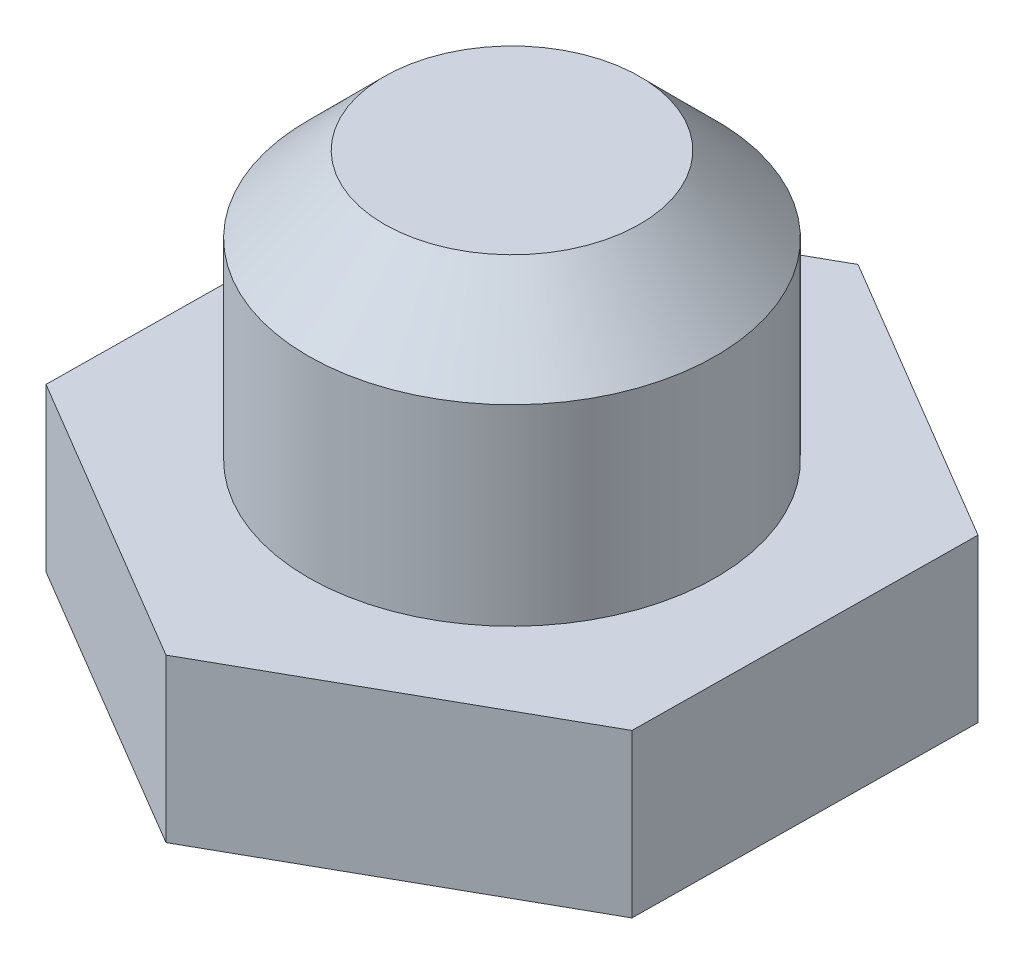
ISO-10303-21;
HEADER;
FILE_DESCRIPTION(('STEP AP214'),'2;1');
FILE_NAME('part.step','',(''),(''),'','','');
FILE_SCHEMA(('AUTOMOTIVE_DESIGN { 1 0 10303 214 1 1 1 1 }'));
ENDSEC;
DATA;
#1=APPLICATION_CONTEXT('core data for automotive mechanical design processes');
#2=APPLICATION_PROTOCOL_DEFINITION('international standard','automotive_design',2000,#1);
#3=PRODUCT_CONTEXT('',#1,'mechanical');
#4=PRODUCT('Part','Part','',(#3));
#5=PRODUCT_RELATED_PRODUCT_CATEGORY('part','',(#4));
#6=PRODUCT_DEFINITION_FORMATION('','',#4);
#7=PRODUCT_DEFINITION_CONTEXT('part definition',#1,'design');
#8=PRODUCT_DEFINITION('design','',#6,#7);
#9=PRODUCT_DEFINITION_SHAPE('','',#8);
#10=(LENGTH_UNIT() NAMED_UNIT(*) SI_UNIT(.MILLI.,.METRE.));
#11=(NAMED_UNIT(*) PLANE_ANGLE_UNIT() SI_UNIT($,.RADIAN.));
#12=(NAMED_UNIT(*) SI_UNIT($,.STERADIAN.) SOLID_ANGLE_UNIT());
#13=UNCERTAINTY_MEASURE_WITH_UNIT(LENGTH_MEASURE(1.E-05),#10,'distance_accuracy_value','');
#14=(GEOMETRIC_REPRESENTATION_CONTEXT(3) GLOBAL_UNCERTAINTY_ASSIGNED_CONTEXT((#13)) GLOBAL_UNIT_ASSIGNED_CONTEXT((#10,
#11,#12)) REPRESENTATION_CONTEXT('',''));
#15=CARTESIAN_POINT('',(0.,0.,0.));
#16=DIRECTION('',(0.,0.,1.));
#17=DIRECTION('',(1.,0.,0.));
#18=AXIS2_PLACEMENT_3D('',#15,#16,#17);
#19=CARTESIAN_POINT('',(0.,-60.706,0.));
#20=DIRECTION('',(0.,-1.,0.));
#21=DIRECTION('',(0.,0.,-1.));
#22=AXIS2_PLACEMENT_3D('',#19,#20,#21);
#23=CYLINDRICAL_SURFACE('',#22,6.38048);
#24=CARTESIAN_POINT('',(0.,-63.086000066,0.));
#25=DIRECTION('',(0.,1.,0.));
#26=DIRECTION('',(0.,0.,1.));
#27=AXIS2_PLACEMENT_3D('',#24,#25,#26);
#28=CIRCLE('',#27,6.38048);
#29=CARTESIAN_POINT('',(0.,-63.086000066,6.38048));
#30=VERTEX_POINT('',#29);
#31=EDGE_CURVE('E11',#30,#30,#28,.F.);
#32=ORIENTED_EDGE('',*,*,#31,.T.);
#33=EDGE_LOOP('',(#32));
#34=FACE_BOUND('',#33,.T.);
#35=CARTESIAN_POINT('',(0.,-69.088,0.));
#36=DIRECTION('',(0.,1.,0.));
#37=DIRECTION('',(0.,0.,1.));
#38=AXIS2_PLACEMENT_3D('',#35,#36,#37);
#39=CIRCLE('',#38,6.38048);
#40=CARTESIAN_POINT('',(0.,-69.088,6.38048));
#41=VERTEX_POINT('',#40);
#42=EDGE_CURVE('E143',#41,#41,#39,.T.);
#43=ORIENTED_EDGE('',*,*,#42,.T.);
#44=EDGE_LOOP('',(#43));
#45=FACE_BOUND('',#44,.T.);
#46=ADVANCED_FACE('F37',(#34,#45),#23,.T.);
#47=CARTESIAN_POINT('',(0.,-60.706,0.));
#48=DIRECTION('',(0.,1.,0.));
#49=DIRECTION('',(0.,0.,1.));
#50=AXIS2_PLACEMENT_3D('',#47,#48,#49);
#51=PLANE('',#50);
#52=CARTESIAN_POINT('',(0.,-60.706,0.));
#53=DIRECTION('',(0.,1.,0.));
#54=DIRECTION('',(0.,0.,1.));
#55=AXIS2_PLACEMENT_3D('',#52,#53,#54);
#56=CIRCLE('',#55,4.00047993399999);
#57=CARTESIAN_POINT('',(0.,-60.706,4.00047993399999));
#58=VERTEX_POINT('',#57);
#59=EDGE_CURVE('E47',#58,#58,#56,.T.);
#60=ORIENTED_EDGE('',*,*,#59,.T.);
#61=EDGE_LOOP('',(#60));
#62=FACE_BOUND('',#61,.T.);
#63=ADVANCED_FACE('F153',(#62),#51,.T.);
#64=CARTESIAN_POINT('',(9.33104509014006,-74.168,-5.24723916541896));
#65=DIRECTION('',(0.509779161806958,0.,-0.860305298244405));
#66=DIRECTION('',(-0.860305298244405,0.,-0.509779161806958));
#67=AXIS2_PLACEMENT_3D('',#64,#65,#66);
#68=PLANE('',#67);
#69=DIRECTION('',(-0.860305298244405,0.,-0.509779161806958));
#70=VECTOR('',#69,1.);
#71=CARTESIAN_POINT('',(9.33104509014006,-69.088,-5.24723916541896));
#72=LINE('',#71,#70);
#73=CARTESIAN_POINT('',(9.33104509014006,-69.088,-5.24723916541896));
#74=VERTEX_POINT('',#73);
#75=CARTESIAN_POINT('',(0.12128012808455,-69.088,-10.7045416746288));
#76=VERTEX_POINT('',#75);
#77=EDGE_CURVE('E126',#74,#76,#72,.T.);
#78=ORIENTED_EDGE('',*,*,#77,.F.);
#79=DIRECTION('',(0.,1.,0.));
#80=VECTOR('',#79,1.);
#81=CARTESIAN_POINT('',(9.33104509014006,-74.168,-5.24723916541896));
#82=LINE('',#81,#80);
#83=CARTESIAN_POINT('',(9.33104509014006,-74.168,-5.24723916541896));
#84=VERTEX_POINT('',#83);
#85=EDGE_CURVE('E55',#84,#74,#82,.T.);
#86=ORIENTED_EDGE('',*,*,#85,.F.);
#87=DIRECTION('',(-0.860305298244405,0.,-0.509779161806958));
#88=VECTOR('',#87,1.);
#89=CARTESIAN_POINT('',(9.33104509014006,-74.168,-5.24723916541896));
#90=LINE('',#89,#88);
#91=CARTESIAN_POINT('',(0.12128012808455,-74.168,-10.7045416746288));
#92=VERTEX_POINT('',#91);
#93=EDGE_CURVE('E141',#84,#92,#90,.T.);
#94=ORIENTED_EDGE('',*,*,#93,.T.);
#95=DIRECTION('',(0.,1.,0.));
#96=VECTOR('',#95,1.);
#97=CARTESIAN_POINT('',(0.12128012808455,-74.168,-10.7045416746288));
#98=LINE('',#97,#96);
#99=EDGE_CURVE('E90',#92,#76,#98,.T.);
#100=ORIENTED_EDGE('',*,*,#99,.T.);
#101=EDGE_LOOP('',(#78,#86,#94,#100));
#102=FACE_BOUND('',#101,.T.);
#103=ADVANCED_FACE('F169',(#102),#68,.T.);
#104=CARTESIAN_POINT('',(9.20976496205551,-74.168,5.45730250920988));
#105=DIRECTION('',(0.999935824193482,0.,0.0113290553225599));
#106=DIRECTION('',(0.0113290553225599,0.,-0.999935824193482));
#107=AXIS2_PLACEMENT_3D('',#104,#105,#106);
#108=PLANE('',#107);
#109=DIRECTION('',(0.0113290553225599,0.,-0.999935824193482));
#110=VECTOR('',#109,1.);
#111=CARTESIAN_POINT('',(9.20976496205551,-69.088,5.45730250920988));
#112=LINE('',#111,#110);
#113=CARTESIAN_POINT('',(9.20976496205551,-69.088,5.45730250920988));
#114=VERTEX_POINT('',#113);
#115=EDGE_CURVE('E138',#114,#74,#112,.T.);
#116=ORIENTED_EDGE('',*,*,#115,.F.);
#117=DIRECTION('',(0.,1.,0.));
#118=VECTOR('',#117,1.);
#119=CARTESIAN_POINT('',(9.20976496205551,-74.168,5.45730250920988));
#120=LINE('',#119,#118);
#121=CARTESIAN_POINT('',(9.20976496205551,-74.168,5.45730250920988));
#122=VERTEX_POINT('',#121);
#123=EDGE_CURVE('E78',#122,#114,#120,.T.);
#124=ORIENTED_EDGE('',*,*,#123,.F.);
#125=DIRECTION('',(0.0113290553225599,0.,-0.999935824193482));
#126=VECTOR('',#125,1.);
#127=CARTESIAN_POINT('',(9.20976496205551,-74.168,5.45730250920988));
#128=LINE('',#127,#126);
#129=EDGE_CURVE('E116',#122,#84,#128,.T.);
#130=ORIENTED_EDGE('',*,*,#129,.T.);
#131=ORIENTED_EDGE('',*,*,#85,.T.);
#132=EDGE_LOOP('',(#116,#124,#130,#131));
#133=FACE_BOUND('',#132,.T.);
#134=ADVANCED_FACE('F175',(#133),#108,.T.);
#135=CARTESIAN_POINT('',(-0.121280128084579,-74.168,10.7045416746289));
#136=DIRECTION('',(0.490156662386524,0.,0.871634353566966));
#137=DIRECTION('',(0.871634353566966,0.,-0.490156662386524));
#138=AXIS2_PLACEMENT_3D('',#135,#136,#137);
#139=PLANE('',#138);
#140=DIRECTION('',(0.871634353566966,0.,-0.490156662386524));
#141=VECTOR('',#140,1.);
#142=CARTESIAN_POINT('',(-0.121280128084579,-69.088,10.7045416746289));
#143=LINE('',#142,#141);
#144=CARTESIAN_POINT('',(-0.121280128084579,-69.088,10.7045416746289));
#145=VERTEX_POINT('',#144);
#146=EDGE_CURVE('E103',#145,#114,#143,.T.);
#147=ORIENTED_EDGE('',*,*,#146,.F.);
#148=DIRECTION('',(0.,1.,0.));
#149=VECTOR('',#148,1.);
#150=CARTESIAN_POINT('',(-0.121280128084579,-74.168,10.7045416746289));
#151=LINE('',#150,#149);
#152=CARTESIAN_POINT('',(-0.121280128084579,-74.168,10.7045416746289));
#153=VERTEX_POINT('',#152);
#154=EDGE_CURVE('E98',#153,#145,#151,.T.);
#155=ORIENTED_EDGE('',*,*,#154,.F.);
#156=DIRECTION('',(0.871634353566966,0.,-0.490156662386524));
#157=VECTOR('',#156,1.);
#158=CARTESIAN_POINT('',(-0.121280128084579,-74.168,10.7045416746289));
#159=LINE('',#158,#157);
#160=EDGE_CURVE('E101',#153,#122,#159,.T.);
#161=ORIENTED_EDGE('',*,*,#160,.T.);
#162=ORIENTED_EDGE('',*,*,#123,.T.);
#163=EDGE_LOOP('',(#147,#155,#161,#162));
#164=FACE_BOUND('',#163,.T.);
#165=ADVANCED_FACE('F100',(#164),#139,.T.);
#166=CARTESIAN_POINT('',(-9.33104509014008,-74.168,5.24723916541897));
#167=DIRECTION('',(-0.509779161806958,0.,0.860305298244405));
#168=DIRECTION('',(0.860305298244405,0.,0.509779161806958));
#169=AXIS2_PLACEMENT_3D('',#166,#167,#168);
#170=PLANE('',#169);
#171=DIRECTION('',(0.860305298244405,0.,0.509779161806958));
#172=VECTOR('',#171,1.);
#173=CARTESIAN_POINT('',(-9.33104509014008,-69.088,5.24723916541897));
#174=LINE('',#173,#172);
#175=CARTESIAN_POINT('',(-9.33104509014008,-69.088,5.24723916541897));
#176=VERTEX_POINT('',#175);
#177=EDGE_CURVE('E135',#176,#145,#174,.T.);
#178=ORIENTED_EDGE('',*,*,#177,.F.);
#179=DIRECTION('',(0.,1.,0.));
#180=VECTOR('',#179,1.);
#181=CARTESIAN_POINT('',(-9.33104509014008,-74.168,5.24723916541897));
#182=LINE('',#181,#180);
#183=CARTESIAN_POINT('',(-9.33104509014008,-74.168,5.24723916541897));
#184=VERTEX_POINT('',#183);
#185=EDGE_CURVE('E108',#184,#176,#182,.T.);
#186=ORIENTED_EDGE('',*,*,#185,.F.);
#187=DIRECTION('',(0.860305298244405,0.,0.509779161806958));
#188=VECTOR('',#187,1.);
#189=CARTESIAN_POINT('',(-9.33104509014008,-74.168,5.24723916541897));
#190=LINE('',#189,#188);
#191=EDGE_CURVE('E114',#184,#153,#190,.T.);
#192=ORIENTED_EDGE('',*,*,#191,.T.);
#193=ORIENTED_EDGE('',*,*,#154,.T.);
#194=EDGE_LOOP('',(#178,#186,#192,#193));
#195=FACE_BOUND('',#194,.T.);
#196=ADVANCED_FACE('F118',(#195),#170,.T.);
#197=CARTESIAN_POINT('',(-9.20976496205553,-74.168,-5.45730250920987));
#198=DIRECTION('',(-0.999935824193482,0.,-0.0113290553225599));
#199=DIRECTION('',(-0.0113290553225599,0.,0.999935824193482));
#200=AXIS2_PLACEMENT_3D('',#197,#198,#199);
#201=PLANE('',#200);
#202=DIRECTION('',(-0.0113290553225599,0.,0.999935824193482));
#203=VECTOR('',#202,1.);
#204=CARTESIAN_POINT('',(-9.20976496205553,-69.088,-5.45730250920987));
#205=LINE('',#204,#203);
#206=CARTESIAN_POINT('',(-9.20976496205553,-69.088,-5.45730250920987));
#207=VERTEX_POINT('',#206);
#208=EDGE_CURVE('E132',#207,#176,#205,.T.);
#209=ORIENTED_EDGE('',*,*,#208,.F.);
#210=DIRECTION('',(0.,1.,0.));
#211=VECTOR('',#210,1.);
#212=CARTESIAN_POINT('',(-9.20976496205553,-74.168,-5.45730250920987));
#213=LINE('',#212,#211);
#214=CARTESIAN_POINT('',(-9.20976496205553,-74.168,-5.45730250920987));
#215=VERTEX_POINT('',#214);
#216=EDGE_CURVE('E146',#215,#207,#213,.T.);
#217=ORIENTED_EDGE('',*,*,#216,.F.);
#218=DIRECTION('',(-0.0113290553225599,0.,0.999935824193482));
#219=VECTOR('',#218,1.);
#220=CARTESIAN_POINT('',(-9.20976496205553,-74.168,-5.45730250920987));
#221=LINE('',#220,#219);
#222=EDGE_CURVE('E119',#215,#184,#221,.T.);
#223=ORIENTED_EDGE('',*,*,#222,.T.);
#224=ORIENTED_EDGE('',*,*,#185,.T.);
#225=EDGE_LOOP('',(#209,#217,#223,#224));
#226=FACE_BOUND('',#225,.T.);
#227=ADVANCED_FACE('F179',(#226),#201,.T.);
#228=CARTESIAN_POINT('',(0.12128012808455,-74.168,-10.7045416746288));
#229=DIRECTION('',(-0.490156662386525,0.,-0.871634353566966));
#230=DIRECTION('',(-0.871634353566966,0.,0.490156662386525));
#231=AXIS2_PLACEMENT_3D('',#228,#229,#230);
#232=PLANE('',#231);
#233=DIRECTION('',(-0.871634353566966,0.,0.490156662386525));
#234=VECTOR('',#233,1.);
#235=CARTESIAN_POINT('',(0.12128012808455,-69.088,-10.7045416746288));
#236=LINE('',#235,#234);
#237=EDGE_CURVE('E129',#76,#207,#236,.T.);
#238=ORIENTED_EDGE('',*,*,#237,.F.);
#239=ORIENTED_EDGE('',*,*,#99,.F.);
#240=DIRECTION('',(-0.871634353566966,0.,0.490156662386525));
#241=VECTOR('',#240,1.);
#242=CARTESIAN_POINT('',(0.12128012808455,-74.168,-10.7045416746288));
#243=LINE('',#242,#241);
#244=EDGE_CURVE('E121',#92,#215,#243,.T.);
#245=ORIENTED_EDGE('',*,*,#244,.T.);
#246=ORIENTED_EDGE('',*,*,#216,.T.);
#247=EDGE_LOOP('',(#238,#239,#245,#246));
#248=FACE_BOUND('',#247,.T.);
#249=ADVANCED_FACE('F176',(#248),#232,.T.);
#250=CARTESIAN_POINT('',(0.,-74.168,0.));
#251=DIRECTION('',(0.,1.,0.));
#252=DIRECTION('',(0.,0.,1.));
#253=AXIS2_PLACEMENT_3D('',#250,#251,#252);
#254=PLANE('',#253);
#255=ORIENTED_EDGE('',*,*,#93,.F.);
#256=ORIENTED_EDGE('',*,*,#129,.F.);
#257=ORIENTED_EDGE('',*,*,#160,.F.);
#258=ORIENTED_EDGE('',*,*,#191,.F.);
#259=ORIENTED_EDGE('',*,*,#222,.F.);
#260=ORIENTED_EDGE('',*,*,#244,.F.);
#261=EDGE_LOOP('',(#255,#256,#257,#258,#259,#260));
#262=FACE_BOUND('',#261,.T.);
#263=ADVANCED_FACE('F112',(#262),#254,.F.);
#264=CARTESIAN_POINT('',(0.,-69.088,0.));
#265=DIRECTION('',(0.,1.,0.));
#266=DIRECTION('',(0.,0.,1.));
#267=AXIS2_PLACEMENT_3D('',#264,#265,#266);
#268=PLANE('',#267);
#269=ORIENTED_EDGE('',*,*,#42,.F.);
#270=EDGE_LOOP('',(#269));
#271=FACE_BOUND('',#270,.T.);
#272=ORIENTED_EDGE('',*,*,#77,.T.);
#273=ORIENTED_EDGE('',*,*,#237,.T.);
#274=ORIENTED_EDGE('',*,*,#208,.T.);
#275=ORIENTED_EDGE('',*,*,#177,.T.);
#276=ORIENTED_EDGE('',*,*,#146,.T.);
#277=ORIENTED_EDGE('',*,*,#115,.T.);
#278=EDGE_LOOP('',(#272,#273,#274,#275,#276,#277));
#279=FACE_BOUND('',#278,.T.);
#280=ADVANCED_FACE('F156',(#271,#279),#268,.T.);
#281=CARTESIAN_POINT('',(0.,-60.706,0.));
#282=DIRECTION('',(0.,-1.,0.));
#283=DIRECTION('',(0.,0.,-1.));
#284=AXIS2_PLACEMENT_3D('',#281,#282,#283);
#285=CONICAL_SURFACE('',#284,4.00047993399999,0.785398163397448);
#286=ORIENTED_EDGE('',*,*,#31,.F.);
#287=EDGE_LOOP('',(#286));
#288=FACE_BOUND('',#287,.T.);
#289=ORIENTED_EDGE('',*,*,#59,.F.);
#290=EDGE_LOOP('',(#289));
#291=FACE_BOUND('',#290,.T.);
#292=ADVANCED_FACE('F40',(#288,#291),#285,.T.);
#293=CLOSED_SHELL('',(#46,#63,#103,#134,#165,#196,#227,#249,#263,#280,#292));
#294=MANIFOLD_SOLID_BREP('B2',#293);
#295=ADVANCED_BREP_SHAPE_REPRESENTATION('',(#18,#294),#14);
#296=SHAPE_DEFINITION_REPRESENTATION(#9,#295);
ENDSEC;
END-ISO-10303-21;
